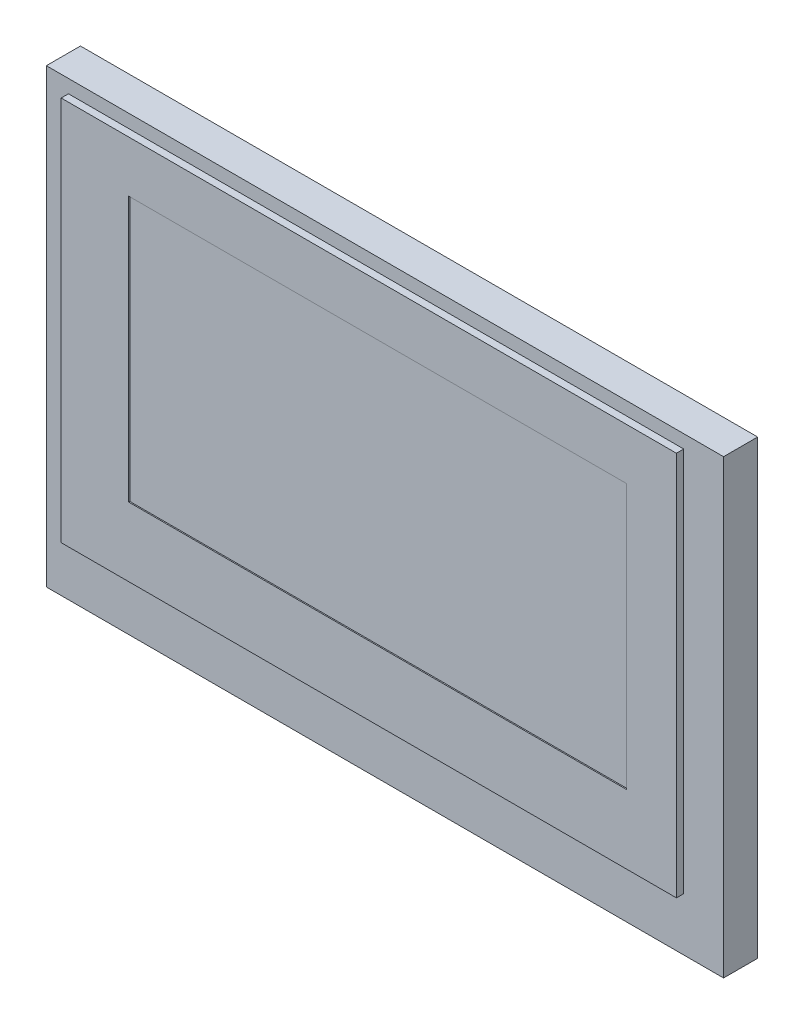
ISO-10303-21;
HEADER;
FILE_DESCRIPTION(('STEP AP214'),'2;1');
FILE_NAME('part.step','',(''),(''),'','','');
FILE_SCHEMA(('AUTOMOTIVE_DESIGN { 1 0 10303 214 1 1 1 1 }'));
ENDSEC;
DATA;
#1=APPLICATION_CONTEXT('core data for automotive mechanical design processes');
#2=APPLICATION_PROTOCOL_DEFINITION('international standard','automotive_design',2000,#1);
#3=PRODUCT_CONTEXT('',#1,'mechanical');
#4=PRODUCT('Part','Part','',(#3));
#5=PRODUCT_RELATED_PRODUCT_CATEGORY('part','',(#4));
#6=PRODUCT_DEFINITION_FORMATION('','',#4);
#7=PRODUCT_DEFINITION_CONTEXT('part definition',#1,'design');
#8=PRODUCT_DEFINITION('design','',#6,#7);
#9=PRODUCT_DEFINITION_SHAPE('','',#8);
#10=(LENGTH_UNIT() NAMED_UNIT(*) SI_UNIT(.MILLI.,.METRE.));
#11=(NAMED_UNIT(*) PLANE_ANGLE_UNIT() SI_UNIT($,.RADIAN.));
#12=(NAMED_UNIT(*) SI_UNIT($,.STERADIAN.) SOLID_ANGLE_UNIT());
#13=UNCERTAINTY_MEASURE_WITH_UNIT(LENGTH_MEASURE(1.E-05),#10,'distance_accuracy_value','');
#14=(GEOMETRIC_REPRESENTATION_CONTEXT(3) GLOBAL_UNCERTAINTY_ASSIGNED_CONTEXT((#13)) GLOBAL_UNIT_ASSIGNED_CONTEXT((#10,
#11,#12)) REPRESENTATION_CONTEXT('',''));
#15=CARTESIAN_POINT('',(0.,0.,0.));
#16=DIRECTION('',(0.,0.,1.));
#17=DIRECTION('',(1.,0.,0.));
#18=AXIS2_PLACEMENT_3D('',#15,#16,#17);
#19=CARTESIAN_POINT('',(0.,0.,0.769999908));
#20=DIRECTION('',(0.,0.,1.));
#21=DIRECTION('',(1.,0.,0.));
#22=AXIS2_PLACEMENT_3D('',#19,#20,#21);
#23=PLANE('',#22);
#24=DIRECTION('',(0.,-1.,0.));
#25=VECTOR('',#24,1.);
#26=CARTESIAN_POINT('',(-88.90512886881,23.3263318522177,0.769999908));
#27=LINE('',#26,#25);
#28=CARTESIAN_POINT('',(-88.90512886881,23.3263318522177,0.769999908));
#29=VERTEX_POINT('',#28);
#30=CARTESIAN_POINT('',(-88.90512886881,13.1263318522177,0.769999908));
#31=VERTEX_POINT('',#30);
#32=EDGE_CURVE('E362',#29,#31,#27,.T.);
#33=ORIENTED_EDGE('',*,*,#32,.T.);
#34=DIRECTION('',(1.,0.,0.));
#35=VECTOR('',#34,1.);
#36=CARTESIAN_POINT('',(-88.90512886881,13.1263318522177,0.769999908));
#37=LINE('',#36,#35);
#38=CARTESIAN_POINT('',(-73.60512886881,13.1263318522177,0.769999908));
#39=VERTEX_POINT('',#38);
#40=EDGE_CURVE('E365',#31,#39,#37,.T.);
#41=ORIENTED_EDGE('',*,*,#40,.T.);
#42=DIRECTION('',(0.,1.,0.));
#43=VECTOR('',#42,1.);
#44=CARTESIAN_POINT('',(-73.60512886881,23.3263318522177,0.769999908));
#45=LINE('',#44,#43);
#46=CARTESIAN_POINT('',(-73.60512886881,23.3263318522177,0.769999908));
#47=VERTEX_POINT('',#46);
#48=EDGE_CURVE('E368',#39,#47,#45,.T.);
#49=ORIENTED_EDGE('',*,*,#48,.T.);
#50=DIRECTION('',(-1.,0.,0.));
#51=VECTOR('',#50,1.);
#52=CARTESIAN_POINT('',(-88.90512886881,23.3263318522177,0.769999908));
#53=LINE('',#52,#51);
#54=EDGE_CURVE('E370',#47,#29,#53,.T.);
#55=ORIENTED_EDGE('',*,*,#54,.T.);
#56=EDGE_LOOP('',(#33,#41,#49,#55));
#57=FACE_BOUND('',#56,.T.);
#58=DIRECTION('',(1.,0.,0.));
#59=VECTOR('',#58,1.);
#60=CARTESIAN_POINT('',(-88.40512886881,14.3263318522177,0.769999908));
#61=LINE('',#60,#59);
#62=CARTESIAN_POINT('',(-88.40512886881,14.3263318522177,0.769999908));
#63=VERTEX_POINT('',#62);
#64=CARTESIAN_POINT('',(-74.50512886881,14.3263318522177,0.769999908));
#65=VERTEX_POINT('',#64);
#66=EDGE_CURVE('E348',#63,#65,#61,.T.);
#67=ORIENTED_EDGE('',*,*,#66,.F.);
#68=DIRECTION('',(0.,-1.,0.));
#69=VECTOR('',#68,1.);
#70=CARTESIAN_POINT('',(-88.40512886881,23.0263318522177,0.769999908));
#71=LINE('',#70,#69);
#72=CARTESIAN_POINT('',(-88.40512886881,23.0263318522177,0.769999908));
#73=VERTEX_POINT('',#72);
#74=EDGE_CURVE('E333',#73,#63,#71,.T.);
#75=ORIENTED_EDGE('',*,*,#74,.F.);
#76=DIRECTION('',(-1.,0.,0.));
#77=VECTOR('',#76,1.);
#78=CARTESIAN_POINT('',(-88.40512886881,23.0263318522177,0.769999908));
#79=LINE('',#78,#77);
#80=CARTESIAN_POINT('',(-74.50512886881,23.0263318522177,0.769999908));
#81=VERTEX_POINT('',#80);
#82=EDGE_CURVE('E339',#81,#73,#79,.T.);
#83=ORIENTED_EDGE('',*,*,#82,.F.);
#84=DIRECTION('',(0.,1.,0.));
#85=VECTOR('',#84,1.);
#86=CARTESIAN_POINT('',(-74.50512886881,23.0263318522177,0.769999908));
#87=LINE('',#86,#85);
#88=EDGE_CURVE('E350',#65,#81,#87,.T.);
#89=ORIENTED_EDGE('',*,*,#88,.F.);
#90=EDGE_LOOP('',(#67,#75,#83,#89));
#91=FACE_BOUND('',#90,.T.);
#92=ADVANCED_FACE('F194',(#57,#91),#23,.T.);
#93=CARTESIAN_POINT('',(-88.90512886881,23.3263318522177,0.769999908));
#94=DIRECTION('',(1.,0.,0.));
#95=DIRECTION('',(0.,0.,-1.));
#96=AXIS2_PLACEMENT_3D('',#93,#94,#95);
#97=PLANE('',#96);
#98=DIRECTION('',(0.,-1.,0.));
#99=VECTOR('',#98,1.);
#100=CARTESIAN_POINT('',(-88.90512886881,23.3263318522177,0.));
#101=LINE('',#100,#99);
#102=CARTESIAN_POINT('',(-88.90512886881,23.3263318522177,0.));
#103=VERTEX_POINT('',#102);
#104=CARTESIAN_POINT('',(-88.90512886881,13.1263318522177,0.));
#105=VERTEX_POINT('',#104);
#106=EDGE_CURVE('E361',#103,#105,#101,.T.);
#107=ORIENTED_EDGE('',*,*,#106,.T.);
#108=DIRECTION('',(0.,0.,-1.));
#109=VECTOR('',#108,1.);
#110=CARTESIAN_POINT('',(-88.90512886881,13.1263318522177,0.769999908));
#111=LINE('',#110,#109);
#112=EDGE_CURVE('E13',#31,#105,#111,.T.);
#113=ORIENTED_EDGE('',*,*,#112,.F.);
#114=ORIENTED_EDGE('',*,*,#32,.F.);
#115=DIRECTION('',(0.,0.,-1.));
#116=VECTOR('',#115,1.);
#117=CARTESIAN_POINT('',(-88.90512886881,23.3263318522177,0.769999908));
#118=LINE('',#117,#116);
#119=EDGE_CURVE('E372',#29,#103,#118,.T.);
#120=ORIENTED_EDGE('',*,*,#119,.T.);
#121=EDGE_LOOP('',(#107,#113,#114,#120));
#122=FACE_BOUND('',#121,.T.);
#123=ADVANCED_FACE('F196',(#122),#97,.F.);
#124=CARTESIAN_POINT('',(-88.90512886881,13.1263318522177,0.769999908));
#125=DIRECTION('',(0.,1.,0.));
#126=DIRECTION('',(0.,0.,1.));
#127=AXIS2_PLACEMENT_3D('',#124,#125,#126);
#128=PLANE('',#127);
#129=DIRECTION('',(1.,0.,0.));
#130=VECTOR('',#129,1.);
#131=CARTESIAN_POINT('',(-88.90512886881,13.1263318522177,0.));
#132=LINE('',#131,#130);
#133=CARTESIAN_POINT('',(-73.60512886881,13.1263318522177,0.));
#134=VERTEX_POINT('',#133);
#135=EDGE_CURVE('E375',#105,#134,#132,.T.);
#136=ORIENTED_EDGE('',*,*,#135,.T.);
#137=DIRECTION('',(0.,0.,-1.));
#138=VECTOR('',#137,1.);
#139=CARTESIAN_POINT('',(-73.60512886881,13.1263318522177,0.769999908));
#140=LINE('',#139,#138);
#141=EDGE_CURVE('E202',#39,#134,#140,.T.);
#142=ORIENTED_EDGE('',*,*,#141,.F.);
#143=ORIENTED_EDGE('',*,*,#40,.F.);
#144=ORIENTED_EDGE('',*,*,#112,.T.);
#145=EDGE_LOOP('',(#136,#142,#143,#144));
#146=FACE_BOUND('',#145,.T.);
#147=ADVANCED_FACE('F405',(#146),#128,.F.);
#148=CARTESIAN_POINT('',(-73.60512886881,23.3263318522177,0.769999908));
#149=DIRECTION('',(-1.,0.,0.));
#150=DIRECTION('',(0.,0.,1.));
#151=AXIS2_PLACEMENT_3D('',#148,#149,#150);
#152=PLANE('',#151);
#153=DIRECTION('',(0.,1.,0.));
#154=VECTOR('',#153,1.);
#155=CARTESIAN_POINT('',(-73.60512886881,23.3263318522177,0.));
#156=LINE('',#155,#154);
#157=CARTESIAN_POINT('',(-73.60512886881,23.3263318522177,0.));
#158=VERTEX_POINT('',#157);
#159=EDGE_CURVE('E377',#134,#158,#156,.T.);
#160=ORIENTED_EDGE('',*,*,#159,.T.);
#161=DIRECTION('',(0.,0.,-1.));
#162=VECTOR('',#161,1.);
#163=CARTESIAN_POINT('',(-73.60512886881,23.3263318522177,0.769999908));
#164=LINE('',#163,#162);
#165=EDGE_CURVE('E382',#47,#158,#164,.T.);
#166=ORIENTED_EDGE('',*,*,#165,.F.);
#167=ORIENTED_EDGE('',*,*,#48,.F.);
#168=ORIENTED_EDGE('',*,*,#141,.T.);
#169=EDGE_LOOP('',(#160,#166,#167,#168));
#170=FACE_BOUND('',#169,.T.);
#171=ADVANCED_FACE('F389',(#170),#152,.F.);
#172=CARTESIAN_POINT('',(-88.90512886881,23.3263318522177,0.769999908));
#173=DIRECTION('',(0.,-1.,0.));
#174=DIRECTION('',(0.,0.,-1.));
#175=AXIS2_PLACEMENT_3D('',#172,#173,#174);
#176=PLANE('',#175);
#177=DIRECTION('',(-1.,0.,0.));
#178=VECTOR('',#177,1.);
#179=CARTESIAN_POINT('',(-88.90512886881,23.3263318522177,0.));
#180=LINE('',#179,#178);
#181=EDGE_CURVE('E366',#158,#103,#180,.T.);
#182=ORIENTED_EDGE('',*,*,#181,.T.);
#183=ORIENTED_EDGE('',*,*,#119,.F.);
#184=ORIENTED_EDGE('',*,*,#54,.F.);
#185=ORIENTED_EDGE('',*,*,#165,.T.);
#186=EDGE_LOOP('',(#182,#183,#184,#185));
#187=FACE_BOUND('',#186,.T.);
#188=ADVANCED_FACE('F398',(#187),#176,.F.);
#189=CARTESIAN_POINT('',(0.,0.,0.));
#190=DIRECTION('',(0.,0.,1.));
#191=DIRECTION('',(1.,0.,0.));
#192=AXIS2_PLACEMENT_3D('',#189,#190,#191);
#193=PLANE('',#192);
#194=ORIENTED_EDGE('',*,*,#106,.F.);
#195=ORIENTED_EDGE('',*,*,#181,.F.);
#196=ORIENTED_EDGE('',*,*,#159,.F.);
#197=ORIENTED_EDGE('',*,*,#135,.F.);
#198=EDGE_LOOP('',(#194,#195,#196,#197));
#199=FACE_BOUND('',#198,.T.);
#200=ADVANCED_FACE('F395',(#199),#193,.F.);
#201=CARTESIAN_POINT('',(-88.40512886881,23.0263318522177,0.934999908));
#202=DIRECTION('',(1.,0.,0.));
#203=DIRECTION('',(0.,0.,-1.));
#204=AXIS2_PLACEMENT_3D('',#201,#202,#203);
#205=PLANE('',#204);
#206=ORIENTED_EDGE('',*,*,#74,.T.);
#207=DIRECTION('',(0.,0.,-1.));
#208=VECTOR('',#207,1.);
#209=CARTESIAN_POINT('',(-88.40512886881,14.3263318522177,0.934999908));
#210=LINE('',#209,#208);
#211=CARTESIAN_POINT('',(-88.40512886881,14.3263318522177,0.934999908));
#212=VERTEX_POINT('',#211);
#213=EDGE_CURVE('E359',#212,#63,#210,.T.);
#214=ORIENTED_EDGE('',*,*,#213,.F.);
#215=DIRECTION('',(0.,-1.,0.));
#216=VECTOR('',#215,1.);
#217=CARTESIAN_POINT('',(-88.40512886881,23.0263318522177,0.934999908));
#218=LINE('',#217,#216);
#219=CARTESIAN_POINT('',(-88.40512886881,23.0263318522177,0.934999908));
#220=VERTEX_POINT('',#219);
#221=EDGE_CURVE('E335',#220,#212,#218,.T.);
#222=ORIENTED_EDGE('',*,*,#221,.F.);
#223=DIRECTION('',(0.,0.,-1.));
#224=VECTOR('',#223,1.);
#225=CARTESIAN_POINT('',(-88.40512886881,23.0263318522177,0.934999908));
#226=LINE('',#225,#224);
#227=EDGE_CURVE('E345',#220,#73,#226,.T.);
#228=ORIENTED_EDGE('',*,*,#227,.T.);
#229=EDGE_LOOP('',(#206,#214,#222,#228));
#230=FACE_BOUND('',#229,.T.);
#231=ADVANCED_FACE('F418',(#230),#205,.F.);
#232=CARTESIAN_POINT('',(-88.40512886881,14.3263318522177,0.934999908));
#233=DIRECTION('',(0.,1.,0.));
#234=DIRECTION('',(0.,0.,1.));
#235=AXIS2_PLACEMENT_3D('',#232,#233,#234);
#236=PLANE('',#235);
#237=ORIENTED_EDGE('',*,*,#66,.T.);
#238=DIRECTION('',(0.,0.,-1.));
#239=VECTOR('',#238,1.);
#240=CARTESIAN_POINT('',(-74.50512886881,14.3263318522177,0.934999908));
#241=LINE('',#240,#239);
#242=CARTESIAN_POINT('',(-74.50512886881,14.3263318522177,0.934999908));
#243=VERTEX_POINT('',#242);
#244=EDGE_CURVE('E356',#243,#65,#241,.T.);
#245=ORIENTED_EDGE('',*,*,#244,.F.);
#246=DIRECTION('',(1.,0.,0.));
#247=VECTOR('',#246,1.);
#248=CARTESIAN_POINT('',(-88.40512886881,14.3263318522177,0.934999908));
#249=LINE('',#248,#247);
#250=EDGE_CURVE('E338',#212,#243,#249,.T.);
#251=ORIENTED_EDGE('',*,*,#250,.F.);
#252=ORIENTED_EDGE('',*,*,#213,.T.);
#253=EDGE_LOOP('',(#237,#245,#251,#252));
#254=FACE_BOUND('',#253,.T.);
#255=ADVANCED_FACE('F437',(#254),#236,.F.);
#256=CARTESIAN_POINT('',(-74.50512886881,23.0263318522177,0.934999908));
#257=DIRECTION('',(-1.,0.,0.));
#258=DIRECTION('',(0.,0.,1.));
#259=AXIS2_PLACEMENT_3D('',#256,#257,#258);
#260=PLANE('',#259);
#261=ORIENTED_EDGE('',*,*,#88,.T.);
#262=DIRECTION('',(0.,0.,-1.));
#263=VECTOR('',#262,1.);
#264=CARTESIAN_POINT('',(-74.50512886881,23.0263318522177,0.934999908));
#265=LINE('',#264,#263);
#266=CARTESIAN_POINT('',(-74.50512886881,23.0263318522177,0.934999908));
#267=VERTEX_POINT('',#266);
#268=EDGE_CURVE('E217',#267,#81,#265,.T.);
#269=ORIENTED_EDGE('',*,*,#268,.F.);
#270=DIRECTION('',(0.,1.,0.));
#271=VECTOR('',#270,1.);
#272=CARTESIAN_POINT('',(-74.50512886881,23.0263318522177,0.934999908));
#273=LINE('',#272,#271);
#274=EDGE_CURVE('E341',#243,#267,#273,.T.);
#275=ORIENTED_EDGE('',*,*,#274,.F.);
#276=ORIENTED_EDGE('',*,*,#244,.T.);
#277=EDGE_LOOP('',(#261,#269,#275,#276));
#278=FACE_BOUND('',#277,.T.);
#279=ADVANCED_FACE('F444',(#278),#260,.F.);
#280=CARTESIAN_POINT('',(-88.40512886881,23.0263318522177,0.934999908));
#281=DIRECTION('',(0.,-1.,0.));
#282=DIRECTION('',(1.,0.,0.));
#283=AXIS2_PLACEMENT_3D('',#280,#281,#282);
#284=PLANE('',#283);
#285=ORIENTED_EDGE('',*,*,#82,.T.);
#286=ORIENTED_EDGE('',*,*,#227,.F.);
#287=DIRECTION('',(-1.,0.,0.));
#288=VECTOR('',#287,1.);
#289=CARTESIAN_POINT('',(-88.40512886881,23.0263318522177,0.934999908));
#290=LINE('',#289,#288);
#291=EDGE_CURVE('E343',#267,#220,#290,.T.);
#292=ORIENTED_EDGE('',*,*,#291,.F.);
#293=ORIENTED_EDGE('',*,*,#268,.T.);
#294=EDGE_LOOP('',(#285,#286,#292,#293));
#295=FACE_BOUND('',#294,.T.);
#296=ADVANCED_FACE('F451',(#295),#284,.F.);
#297=CARTESIAN_POINT('',(0.,0.,0.934999908));
#298=DIRECTION('',(0.,0.,1.));
#299=DIRECTION('',(1.,0.,0.));
#300=AXIS2_PLACEMENT_3D('',#297,#298,#299);
#301=PLANE('',#300);
#302=DIRECTION('',(0.,1.,0.));
#303=VECTOR('',#302,1.);
#304=CARTESIAN_POINT('',(-75.63012886881,21.8693318522177,0.934999908));
#305=LINE('',#304,#303);
#306=CARTESIAN_POINT('',(-75.63012886881,15.8833318522177,0.934999908));
#307=VERTEX_POINT('',#306);
#308=CARTESIAN_POINT('',(-75.63012886881,21.8693318522177,0.934999908));
#309=VERTEX_POINT('',#308);
#310=EDGE_CURVE('E298',#307,#309,#305,.T.);
#311=ORIENTED_EDGE('',*,*,#310,.F.);
#312=DIRECTION('',(1.,0.,0.));
#313=VECTOR('',#312,1.);
#314=CARTESIAN_POINT('',(-86.88012886881,15.8833318522177,0.934999908));
#315=LINE('',#314,#313);
#316=CARTESIAN_POINT('',(-86.88012886881,15.8833318522177,0.934999908));
#317=VERTEX_POINT('',#316);
#318=EDGE_CURVE('E304',#317,#307,#315,.T.);
#319=ORIENTED_EDGE('',*,*,#318,.F.);
#320=DIRECTION('',(0.,-1.,0.));
#321=VECTOR('',#320,1.);
#322=CARTESIAN_POINT('',(-86.88012886881,21.8693318522177,0.934999908));
#323=LINE('',#322,#321);
#324=CARTESIAN_POINT('',(-86.88012886881,21.8693318522177,0.934999908));
#325=VERTEX_POINT('',#324);
#326=EDGE_CURVE('E209',#325,#317,#323,.T.);
#327=ORIENTED_EDGE('',*,*,#326,.F.);
#328=DIRECTION('',(-1.,0.,0.));
#329=VECTOR('',#328,1.);
#330=CARTESIAN_POINT('',(-86.88012886881,21.8693318522177,0.934999908));
#331=LINE('',#330,#329);
#332=EDGE_CURVE('E288',#309,#325,#331,.T.);
#333=ORIENTED_EDGE('',*,*,#332,.F.);
#334=EDGE_LOOP('',(#311,#319,#327,#333));
#335=FACE_BOUND('',#334,.T.);
#336=ORIENTED_EDGE('',*,*,#221,.T.);
#337=ORIENTED_EDGE('',*,*,#250,.T.);
#338=ORIENTED_EDGE('',*,*,#274,.T.);
#339=ORIENTED_EDGE('',*,*,#291,.T.);
#340=EDGE_LOOP('',(#336,#337,#338,#339));
#341=FACE_BOUND('',#340,.T.);
#342=ADVANCED_FACE('F306',(#335,#341),#301,.T.);
#343=CARTESIAN_POINT('',(-75.63012886881,21.8693318522177,0.934999908));
#344=DIRECTION('',(1.,0.,0.));
#345=DIRECTION('',(0.,1.,0.));
#346=AXIS2_PLACEMENT_3D('',#343,#344,#345);
#347=PLANE('',#346);
#348=DIRECTION('',(0.,0.,1.));
#349=VECTOR('',#348,1.);
#350=CARTESIAN_POINT('',(-75.63012886881,15.8833318522177,0.934999908));
#351=LINE('',#350,#349);
#352=CARTESIAN_POINT('',(-75.63012886881,15.8833318522177,0.909599908));
#353=VERTEX_POINT('',#352);
#354=EDGE_CURVE('E294',#353,#307,#351,.T.);
#355=ORIENTED_EDGE('',*,*,#354,.T.);
#356=ORIENTED_EDGE('',*,*,#310,.T.);
#357=DIRECTION('',(0.,0.,1.));
#358=VECTOR('',#357,1.);
#359=CARTESIAN_POINT('',(-75.63012886881,21.8693318522177,0.934999908));
#360=LINE('',#359,#358);
#361=CARTESIAN_POINT('',(-75.63012886881,21.8693318522177,0.909599908));
#362=VERTEX_POINT('',#361);
#363=EDGE_CURVE('E284',#362,#309,#360,.T.);
#364=ORIENTED_EDGE('',*,*,#363,.F.);
#365=DIRECTION('',(0.,1.,0.));
#366=VECTOR('',#365,1.);
#367=CARTESIAN_POINT('',(-75.63012886881,0.,0.909599908));
#368=LINE('',#367,#366);
#369=EDGE_CURVE('E326',#353,#362,#368,.T.);
#370=ORIENTED_EDGE('',*,*,#369,.F.);
#371=EDGE_LOOP('',(#355,#356,#364,#370));
#372=FACE_BOUND('',#371,.T.);
#373=ADVANCED_FACE('F299',(#372),#347,.F.);
#374=CARTESIAN_POINT('',(-86.88012886881,21.8693318522177,0.934999908));
#375=DIRECTION('',(0.,1.,0.));
#376=DIRECTION('',(-1.,0.,0.));
#377=AXIS2_PLACEMENT_3D('',#374,#375,#376);
#378=PLANE('',#377);
#379=ORIENTED_EDGE('',*,*,#363,.T.);
#380=ORIENTED_EDGE('',*,*,#332,.T.);
#381=DIRECTION('',(0.,0.,1.));
#382=VECTOR('',#381,1.);
#383=CARTESIAN_POINT('',(-86.88012886881,21.8693318522177,0.934999908));
#384=LINE('',#383,#382);
#385=CARTESIAN_POINT('',(-86.88012886881,21.8693318522177,0.909599908));
#386=VERTEX_POINT('',#385);
#387=EDGE_CURVE('E295',#386,#325,#384,.T.);
#388=ORIENTED_EDGE('',*,*,#387,.F.);
#389=DIRECTION('',(1.,0.,0.));
#390=VECTOR('',#389,1.);
#391=CARTESIAN_POINT('',(0.,21.8693318522177,0.909599908));
#392=LINE('',#391,#390);
#393=EDGE_CURVE('E290',#362,#386,#392,.F.);
#394=ORIENTED_EDGE('',*,*,#393,.F.);
#395=EDGE_LOOP('',(#379,#380,#388,#394));
#396=FACE_BOUND('',#395,.T.);
#397=ADVANCED_FACE('F286',(#396),#378,.F.);
#398=CARTESIAN_POINT('',(-86.88012886881,21.8693318522177,0.934999908));
#399=DIRECTION('',(-1.,0.,0.));
#400=DIRECTION('',(0.,-1.,0.));
#401=AXIS2_PLACEMENT_3D('',#398,#399,#400);
#402=PLANE('',#401);
#403=ORIENTED_EDGE('',*,*,#387,.T.);
#404=ORIENTED_EDGE('',*,*,#326,.T.);
#405=DIRECTION('',(0.,0.,1.));
#406=VECTOR('',#405,1.);
#407=CARTESIAN_POINT('',(-86.88012886881,15.8833318522177,0.934999908));
#408=LINE('',#407,#406);
#409=CARTESIAN_POINT('',(-86.88012886881,15.8833318522177,0.909599908));
#410=VERTEX_POINT('',#409);
#411=EDGE_CURVE('E309',#410,#317,#408,.T.);
#412=ORIENTED_EDGE('',*,*,#411,.F.);
#413=DIRECTION('',(0.,1.,0.));
#414=VECTOR('',#413,1.);
#415=CARTESIAN_POINT('',(-86.88012886881,0.,0.909599908));
#416=LINE('',#415,#414);
#417=EDGE_CURVE('E319',#386,#410,#416,.F.);
#418=ORIENTED_EDGE('',*,*,#417,.F.);
#419=EDGE_LOOP('',(#403,#404,#412,#418));
#420=FACE_BOUND('',#419,.T.);
#421=ADVANCED_FACE('F477',(#420),#402,.F.);
#422=CARTESIAN_POINT('',(-86.88012886881,15.8833318522177,0.934999908));
#423=DIRECTION('',(0.,-1.,0.));
#424=DIRECTION('',(1.,0.,0.));
#425=AXIS2_PLACEMENT_3D('',#422,#423,#424);
#426=PLANE('',#425);
#427=DIRECTION('',(1.,0.,0.));
#428=VECTOR('',#427,1.);
#429=CARTESIAN_POINT('',(0.,15.8833318522177,0.909599908));
#430=LINE('',#429,#428);
#431=EDGE_CURVE('E323',#410,#353,#430,.T.);
#432=ORIENTED_EDGE('',*,*,#431,.F.);
#433=ORIENTED_EDGE('',*,*,#411,.T.);
#434=ORIENTED_EDGE('',*,*,#318,.T.);
#435=ORIENTED_EDGE('',*,*,#354,.F.);
#436=EDGE_LOOP('',(#432,#433,#434,#435));
#437=FACE_BOUND('',#436,.T.);
#438=ADVANCED_FACE('F484',(#437),#426,.F.);
#439=CARTESIAN_POINT('',(0.,0.,0.909599908));
#440=DIRECTION('',(0.,0.,1.));
#441=DIRECTION('',(1.,0.,0.));
#442=AXIS2_PLACEMENT_3D('',#439,#440,#441);
#443=PLANE('',#442);
#444=ORIENTED_EDGE('',*,*,#417,.T.);
#445=ORIENTED_EDGE('',*,*,#431,.T.);
#446=ORIENTED_EDGE('',*,*,#369,.T.);
#447=ORIENTED_EDGE('',*,*,#393,.T.);
#448=EDGE_LOOP('',(#444,#445,#446,#447));
#449=FACE_BOUND('',#448,.T.);
#450=ADVANCED_FACE('F491',(#449),#443,.T.);
#451=CLOSED_SHELL('',(#92,#123,#147,#171,#188,#200,#231,#255,#279,#296,#342,#373,#397,#421,#438,#450));
#452=MANIFOLD_SOLID_BREP('B2',#451);
#453=ADVANCED_BREP_SHAPE_REPRESENTATION('',(#18,#452),#14);
#454=SHAPE_DEFINITION_REPRESENTATION(#9,#453);
ENDSEC;
END-ISO-10303-21;
